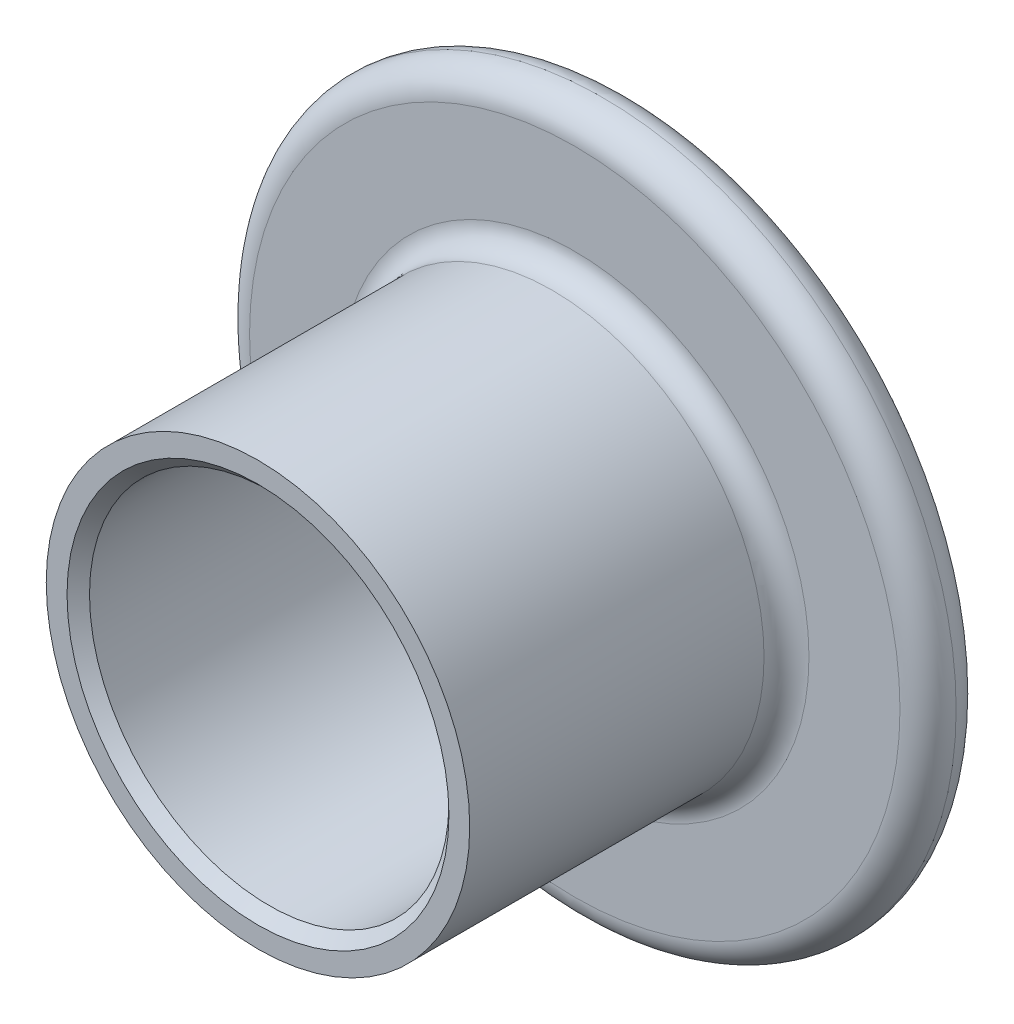
ISO-10303-21;
HEADER;
FILE_DESCRIPTION(('STEP AP214'),'2;1');
FILE_NAME('part.step','',(''),(''),'','','');
FILE_SCHEMA(('AUTOMOTIVE_DESIGN { 1 0 10303 214 1 1 1 1 }'));
ENDSEC;
DATA;
#1=APPLICATION_CONTEXT('core data for automotive mechanical design processes');
#2=APPLICATION_PROTOCOL_DEFINITION('international standard','automotive_design',2000,#1);
#3=PRODUCT_CONTEXT('',#1,'mechanical');
#4=PRODUCT('Part','Part','',(#3));
#5=PRODUCT_RELATED_PRODUCT_CATEGORY('part','',(#4));
#6=PRODUCT_DEFINITION_FORMATION('','',#4);
#7=PRODUCT_DEFINITION_CONTEXT('part definition',#1,'design');
#8=PRODUCT_DEFINITION('design','',#6,#7);
#9=PRODUCT_DEFINITION_SHAPE('','',#8);
#10=(LENGTH_UNIT() NAMED_UNIT(*) SI_UNIT(.MILLI.,.METRE.));
#11=(NAMED_UNIT(*) PLANE_ANGLE_UNIT() SI_UNIT($,.RADIAN.));
#12=(NAMED_UNIT(*) SI_UNIT($,.STERADIAN.) SOLID_ANGLE_UNIT());
#13=UNCERTAINTY_MEASURE_WITH_UNIT(LENGTH_MEASURE(1.E-05),#10,'distance_accuracy_value','');
#14=(GEOMETRIC_REPRESENTATION_CONTEXT(3) GLOBAL_UNCERTAINTY_ASSIGNED_CONTEXT((#13)) GLOBAL_UNIT_ASSIGNED_CONTEXT((#10,
#11,#12)) REPRESENTATION_CONTEXT('',''));
#15=CARTESIAN_POINT('',(0.,0.,0.));
#16=DIRECTION('',(0.,0.,1.));
#17=DIRECTION('',(1.,0.,0.));
#18=AXIS2_PLACEMENT_3D('',#15,#16,#17);
#19=CARTESIAN_POINT('',(0.,0.,-2.5));
#20=DIRECTION('',(0.,0.,1.));
#21=DIRECTION('',(1.,0.,0.));
#22=AXIS2_PLACEMENT_3D('',#19,#20,#21);
#23=PLANE('',#22);
#24=CARTESIAN_POINT('',(0.,0.,-2.5));
#25=DIRECTION('',(0.,0.,1.));
#26=DIRECTION('',(1.,0.,0.));
#27=AXIS2_PLACEMENT_3D('',#24,#25,#26);
#28=CIRCLE('',#27,28.95);
#29=CARTESIAN_POINT('',(28.95,0.,-2.5));
#30=VERTEX_POINT('',#29);
#31=EDGE_CURVE('E47',#30,#30,#28,.F.);
#32=ORIENTED_EDGE('',*,*,#31,.T.);
#33=EDGE_LOOP('',(#32));
#34=FACE_BOUND('',#33,.T.);
#35=CARTESIAN_POINT('',(0.,0.,-2.5));
#36=DIRECTION('',(0.,0.,1.));
#37=DIRECTION('',(1.,0.,0.));
#38=AXIS2_PLACEMENT_3D('',#35,#36,#37);
#39=CIRCLE('',#38,19.15);
#40=CARTESIAN_POINT('',(19.15,0.,-2.5));
#41=VERTEX_POINT('',#40);
#42=EDGE_CURVE('E68',#41,#41,#39,.F.);
#43=ORIENTED_EDGE('',*,*,#42,.F.);
#44=EDGE_LOOP('',(#43));
#45=FACE_BOUND('',#44,.T.);
#46=ADVANCED_FACE('F32',(#34,#45),#23,.F.);
#47=CARTESIAN_POINT('',(0.,0.,2.5));
#48=DIRECTION('',(0.,0.,1.));
#49=DIRECTION('',(1.,0.,0.));
#50=AXIS2_PLACEMENT_3D('',#47,#48,#49);
#51=PLANE('',#50);
#52=CARTESIAN_POINT('',(0.,0.,2.5));
#53=DIRECTION('',(0.,0.,1.));
#54=DIRECTION('',(1.,0.,0.));
#55=AXIS2_PLACEMENT_3D('',#52,#53,#54);
#56=CIRCLE('',#55,28.95);
#57=CARTESIAN_POINT('',(28.95,0.,2.5));
#58=VERTEX_POINT('',#57);
#59=EDGE_CURVE('E43',#58,#58,#56,.T.);
#60=ORIENTED_EDGE('',*,*,#59,.T.);
#61=EDGE_LOOP('',(#60));
#62=FACE_BOUND('',#61,.T.);
#63=CARTESIAN_POINT('',(0.,0.,2.5));
#64=DIRECTION('',(0.,0.,1.));
#65=DIRECTION('',(1.,0.,0.));
#66=AXIS2_PLACEMENT_3D('',#63,#64,#65);
#67=CIRCLE('',#66,20.85);
#68=CARTESIAN_POINT('',(20.85,0.,2.5));
#69=VERTEX_POINT('',#68);
#70=EDGE_CURVE('E62',#69,#69,#67,.F.);
#71=ORIENTED_EDGE('',*,*,#70,.T.);
#72=EDGE_LOOP('',(#71));
#73=FACE_BOUND('',#72,.T.);
#74=ADVANCED_FACE('F94',(#62,#73),#51,.T.);
#75=CARTESIAN_POINT('',(0.,0.,30.7));
#76=DIRECTION('',(0.,0.,-1.));
#77=DIRECTION('',(-1.,0.,0.));
#78=AXIS2_PLACEMENT_3D('',#75,#76,#77);
#79=CYLINDRICAL_SURFACE('',#78,18.85);
#80=CARTESIAN_POINT('',(0.,0.,4.5));
#81=DIRECTION('',(0.,0.,1.));
#82=DIRECTION('',(1.,0.,0.));
#83=AXIS2_PLACEMENT_3D('',#80,#81,#82);
#84=CIRCLE('',#83,18.85);
#85=CARTESIAN_POINT('',(18.85,0.,4.5));
#86=VERTEX_POINT('',#85);
#87=EDGE_CURVE('E65',#86,#86,#84,.T.);
#88=ORIENTED_EDGE('',*,*,#87,.T.);
#89=EDGE_LOOP('',(#88));
#90=FACE_BOUND('',#89,.T.);
#91=CARTESIAN_POINT('',(0.,0.,30.7));
#92=DIRECTION('',(0.,0.,1.));
#93=DIRECTION('',(1.,0.,0.));
#94=AXIS2_PLACEMENT_3D('',#91,#92,#93);
#95=CIRCLE('',#94,18.85);
#96=CARTESIAN_POINT('',(18.85,0.,30.7));
#97=VERTEX_POINT('',#96);
#98=EDGE_CURVE('E71',#97,#97,#95,.T.);
#99=ORIENTED_EDGE('',*,*,#98,.F.);
#100=EDGE_LOOP('',(#99));
#101=FACE_BOUND('',#100,.T.);
#102=ADVANCED_FACE('F100',(#90,#101),#79,.T.);
#103=CARTESIAN_POINT('',(0.,0.,30.7));
#104=DIRECTION('',(0.,0.,1.));
#105=DIRECTION('',(1.,0.,0.));
#106=AXIS2_PLACEMENT_3D('',#103,#104,#105);
#107=PLANE('',#106);
#108=CARTESIAN_POINT('',(0.,0.,30.7));
#109=DIRECTION('',(0.,0.,1.));
#110=DIRECTION('',(1.,0.,0.));
#111=AXIS2_PLACEMENT_3D('',#108,#109,#110);
#112=CIRCLE('',#111,17.);
#113=CARTESIAN_POINT('',(17.,0.,30.7));
#114=VERTEX_POINT('',#113);
#115=EDGE_CURVE('E56',#114,#114,#112,.F.);
#116=ORIENTED_EDGE('',*,*,#115,.T.);
#117=EDGE_LOOP('',(#116));
#118=FACE_BOUND('',#117,.T.);
#119=ORIENTED_EDGE('',*,*,#98,.T.);
#120=EDGE_LOOP('',(#119));
#121=FACE_BOUND('',#120,.T.);
#122=ADVANCED_FACE('F128',(#118,#121),#107,.T.);
#123=CARTESIAN_POINT('',(0.,0.,-7.5));
#124=DIRECTION('',(0.,0.,1.));
#125=DIRECTION('',(1.,0.,0.));
#126=AXIS2_PLACEMENT_3D('',#123,#124,#125);
#127=CYLINDRICAL_SURFACE('',#126,19.15);
#128=CARTESIAN_POINT('',(0.,0.,-6.));
#129=DIRECTION('',(0.,0.,-1.));
#130=DIRECTION('',(-1.,0.,0.));
#131=AXIS2_PLACEMENT_3D('',#128,#129,#130);
#132=CIRCLE('',#131,19.15);
#133=CARTESIAN_POINT('',(-19.15,0.,-6.));
#134=VERTEX_POINT('',#133);
#135=EDGE_CURVE('E10',#134,#134,#132,.F.);
#136=ORIENTED_EDGE('',*,*,#135,.T.);
#137=EDGE_LOOP('',(#136));
#138=FACE_BOUND('',#137,.T.);
#139=ORIENTED_EDGE('',*,*,#42,.T.);
#140=EDGE_LOOP('',(#139));
#141=FACE_BOUND('',#140,.T.);
#142=ADVANCED_FACE('F91',(#138,#141),#127,.T.);
#143=CARTESIAN_POINT('',(0.,0.,-7.5));
#144=DIRECTION('',(0.,0.,-1.));
#145=DIRECTION('',(-1.,0.,0.));
#146=AXIS2_PLACEMENT_3D('',#143,#144,#145);
#147=PLANE('',#146);
#148=CARTESIAN_POINT('',(0.,0.,-7.5));
#149=DIRECTION('',(0.,0.,-1.));
#150=DIRECTION('',(-1.,0.,0.));
#151=AXIS2_PLACEMENT_3D('',#148,#149,#150);
#152=CIRCLE('',#151,17.65);
#153=CARTESIAN_POINT('',(-17.65,0.,-7.5));
#154=VERTEX_POINT('',#153);
#155=EDGE_CURVE('E39',#154,#154,#152,.T.);
#156=ORIENTED_EDGE('',*,*,#155,.T.);
#157=EDGE_LOOP('',(#156));
#158=FACE_BOUND('',#157,.T.);
#159=CARTESIAN_POINT('',(0.,0.,-7.5));
#160=DIRECTION('',(0.,0.,1.));
#161=DIRECTION('',(1.,0.,0.));
#162=AXIS2_PLACEMENT_3D('',#159,#160,#161);
#163=CIRCLE('',#162,16.);
#164=CARTESIAN_POINT('',(16.,0.,-7.5));
#165=VERTEX_POINT('',#164);
#166=EDGE_CURVE('E52',#165,#165,#163,.T.);
#167=ORIENTED_EDGE('',*,*,#166,.T.);
#168=EDGE_LOOP('',(#167));
#169=FACE_BOUND('',#168,.T.);
#170=ADVANCED_FACE('F77',(#158,#169),#147,.T.);
#171=CARTESIAN_POINT('',(0.,0.,-7.5));
#172=DIRECTION('',(0.,0.,1.));
#173=DIRECTION('',(1.,0.,0.));
#174=AXIS2_PLACEMENT_3D('',#171,#172,#173);
#175=CYLINDRICAL_SURFACE('',#174,16.);
#176=CARTESIAN_POINT('',(0.,0.,29.7));
#177=DIRECTION('',(0.,0.,1.));
#178=DIRECTION('',(1.,0.,0.));
#179=AXIS2_PLACEMENT_3D('',#176,#177,#178);
#180=CIRCLE('',#179,16.);
#181=CARTESIAN_POINT('',(16.,0.,29.7));
#182=VERTEX_POINT('',#181);
#183=EDGE_CURVE('E59',#182,#182,#180,.T.);
#184=ORIENTED_EDGE('',*,*,#183,.T.);
#185=EDGE_LOOP('',(#184));
#186=FACE_BOUND('',#185,.T.);
#187=ORIENTED_EDGE('',*,*,#166,.F.);
#188=EDGE_LOOP('',(#187));
#189=FACE_BOUND('',#188,.T.);
#190=ADVANCED_FACE('F79',(#186,#189),#175,.F.);
#191=CARTESIAN_POINT('',(0.,0.,4.5));
#192=DIRECTION('',(0.,0.,1.));
#193=DIRECTION('',(1.,0.,0.));
#194=AXIS2_PLACEMENT_3D('',#191,#192,#193);
#195=TOROIDAL_SURFACE('',#194,20.85,2.);
#196=ORIENTED_EDGE('',*,*,#70,.F.);
#197=EDGE_LOOP('',(#196));
#198=FACE_BOUND('',#197,.T.);
#199=ORIENTED_EDGE('',*,*,#87,.F.);
#200=EDGE_LOOP('',(#199));
#201=FACE_BOUND('',#200,.T.);
#202=ADVANCED_FACE('F81',(#198,#201),#195,.F.);
#203=CARTESIAN_POINT('',(0.,0.,29.7));
#204=DIRECTION('',(0.,0.,1.));
#205=DIRECTION('',(1.,0.,0.));
#206=AXIS2_PLACEMENT_3D('',#203,#204,#205);
#207=CONICAL_SURFACE('',#206,16.,0.785398163397448);
#208=ORIENTED_EDGE('',*,*,#115,.F.);
#209=EDGE_LOOP('',(#208));
#210=FACE_BOUND('',#209,.T.);
#211=ORIENTED_EDGE('',*,*,#183,.F.);
#212=EDGE_LOOP('',(#211));
#213=FACE_BOUND('',#212,.T.);
#214=ADVANCED_FACE('F88',(#210,#213),#207,.F.);
#215=CARTESIAN_POINT('',(0.,0.,0.));
#216=DIRECTION('',(0.,0.,1.));
#217=DIRECTION('',(1.,0.,0.));
#218=AXIS2_PLACEMENT_3D('',#215,#216,#217);
#219=TOROIDAL_SURFACE('',#218,28.95,2.5);
#220=ORIENTED_EDGE('',*,*,#59,.F.);
#221=EDGE_LOOP('',(#220));
#222=FACE_BOUND('',#221,.T.);
#223=CARTESIAN_POINT('',(0.,0.,0.));
#224=DIRECTION('',(0.,0.,1.));
#225=DIRECTION('',(1.,0.,0.));
#226=AXIS2_PLACEMENT_3D('',#223,#224,#225);
#227=CIRCLE('',#226,31.45);
#228=CARTESIAN_POINT('',(31.45,0.,0.));
#229=VERTEX_POINT('',#228);
#230=EDGE_CURVE('E50',#229,#229,#227,.F.);
#231=ORIENTED_EDGE('',*,*,#230,.F.);
#232=EDGE_LOOP('',(#231));
#233=FACE_BOUND('',#232,.T.);
#234=ADVANCED_FACE('F108',(#222,#233),#219,.T.);
#235=CARTESIAN_POINT('',(0.,0.,0.));
#236=DIRECTION('',(0.,0.,1.));
#237=DIRECTION('',(1.,0.,0.));
#238=AXIS2_PLACEMENT_3D('',#235,#236,#237);
#239=TOROIDAL_SURFACE('',#238,28.95,2.5);
#240=ORIENTED_EDGE('',*,*,#31,.F.);
#241=EDGE_LOOP('',(#240));
#242=FACE_BOUND('',#241,.T.);
#243=ORIENTED_EDGE('',*,*,#230,.T.);
#244=EDGE_LOOP('',(#243));
#245=FACE_BOUND('',#244,.T.);
#246=ADVANCED_FACE('F110',(#242,#245),#239,.T.);
#247=CARTESIAN_POINT('',(0.,0.,-6.));
#248=DIRECTION('',(0.,0.,-1.));
#249=DIRECTION('',(-1.,0.,0.));
#250=AXIS2_PLACEMENT_3D('',#247,#248,#249);
#251=TOROIDAL_SURFACE('',#250,17.65,1.5);
#252=ORIENTED_EDGE('',*,*,#135,.F.);
#253=EDGE_LOOP('',(#252));
#254=FACE_BOUND('',#253,.T.);
#255=ORIENTED_EDGE('',*,*,#155,.F.);
#256=EDGE_LOOP('',(#255));
#257=FACE_BOUND('',#256,.T.);
#258=ADVANCED_FACE('F34',(#254,#257),#251,.T.);
#259=CLOSED_SHELL('',(#46,#74,#102,#122,#142,#170,#190,#202,#214,#234,#246,#258));
#260=MANIFOLD_SOLID_BREP('B2',#259);
#261=ADVANCED_BREP_SHAPE_REPRESENTATION('',(#18,#260),#14);
#262=SHAPE_DEFINITION_REPRESENTATION(#9,#261);
ENDSEC;
END-ISO-10303-21;
